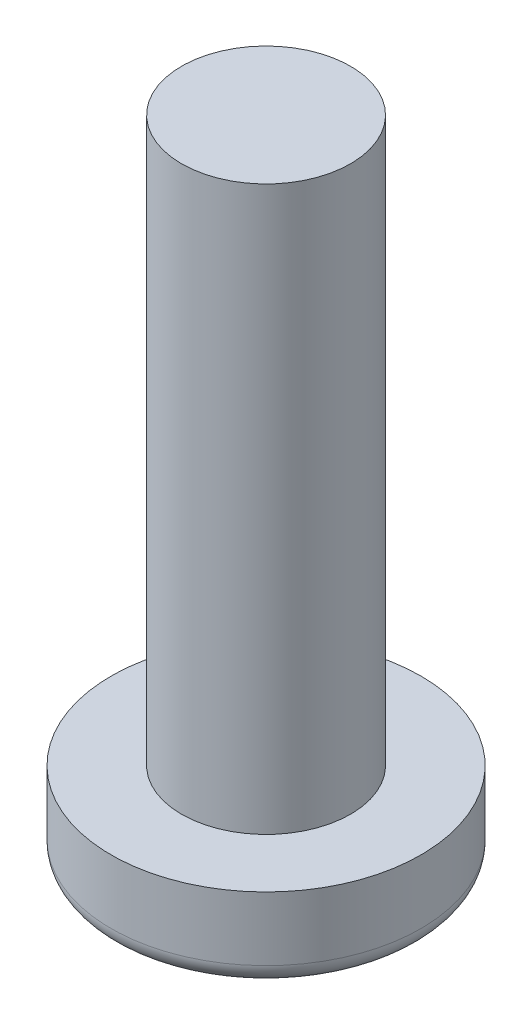
ISO-10303-21;
HEADER;
FILE_DESCRIPTION(('STEP AP214'),'2;1');
FILE_NAME('part.step','',(''),(''),'','','');
FILE_SCHEMA(('AUTOMOTIVE_DESIGN { 1 0 10303 214 1 1 1 1 }'));
ENDSEC;
DATA;
#1=APPLICATION_CONTEXT('core data for automotive mechanical design processes');
#2=APPLICATION_PROTOCOL_DEFINITION('international standard','automotive_design',2000,#1);
#3=PRODUCT_CONTEXT('',#1,'mechanical');
#4=PRODUCT('Part','Part','',(#3));
#5=PRODUCT_RELATED_PRODUCT_CATEGORY('part','',(#4));
#6=PRODUCT_DEFINITION_FORMATION('','',#4);
#7=PRODUCT_DEFINITION_CONTEXT('part definition',#1,'design');
#8=PRODUCT_DEFINITION('design','',#6,#7);
#9=PRODUCT_DEFINITION_SHAPE('','',#8);
#10=(LENGTH_UNIT() NAMED_UNIT(*) SI_UNIT(.MILLI.,.METRE.));
#11=(NAMED_UNIT(*) PLANE_ANGLE_UNIT() SI_UNIT($,.RADIAN.));
#12=(NAMED_UNIT(*) SI_UNIT($,.STERADIAN.) SOLID_ANGLE_UNIT());
#13=UNCERTAINTY_MEASURE_WITH_UNIT(LENGTH_MEASURE(1.E-05),#10,'distance_accuracy_value','');
#14=(GEOMETRIC_REPRESENTATION_CONTEXT(3) GLOBAL_UNCERTAINTY_ASSIGNED_CONTEXT((#13)) GLOBAL_UNIT_ASSIGNED_CONTEXT((#10,
#11,#12)) REPRESENTATION_CONTEXT('',''));
#15=CARTESIAN_POINT('',(0.,0.,0.));
#16=DIRECTION('',(0.,0.,1.));
#17=DIRECTION('',(1.,0.,0.));
#18=AXIS2_PLACEMENT_3D('',#15,#16,#17);
#19=CARTESIAN_POINT('',(0.,1.5,0.));
#20=DIRECTION('',(0.,-1.,0.));
#21=DIRECTION('',(0.,0.,-1.));
#22=AXIS2_PLACEMENT_3D('',#19,#20,#21);
#23=CYLINDRICAL_SURFACE('',#22,2.75);
#24=CARTESIAN_POINT('',(0.,0.367346938775511,0.));
#25=DIRECTION('',(0.,-1.,0.));
#26=DIRECTION('',(0.,0.,-1.));
#27=AXIS2_PLACEMENT_3D('',#24,#25,#26);
#28=CIRCLE('',#27,2.75);
#29=CARTESIAN_POINT('',(0.,0.367346938775511,-2.75));
#30=VERTEX_POINT('',#29);
#31=EDGE_CURVE('E10',#30,#30,#28,.F.);
#32=ORIENTED_EDGE('',*,*,#31,.T.);
#33=EDGE_LOOP('',(#32));
#34=FACE_BOUND('',#33,.T.);
#35=CARTESIAN_POINT('',(0.,1.5,0.));
#36=DIRECTION('',(0.,-1.,0.));
#37=DIRECTION('',(0.,0.,-1.));
#38=AXIS2_PLACEMENT_3D('',#35,#36,#37);
#39=CIRCLE('',#38,2.75);
#40=CARTESIAN_POINT('',(0.,1.5,-2.75));
#41=VERTEX_POINT('',#40);
#42=EDGE_CURVE('E42',#41,#41,#39,.T.);
#43=ORIENTED_EDGE('',*,*,#42,.T.);
#44=EDGE_LOOP('',(#43));
#45=FACE_BOUND('',#44,.T.);
#46=ADVANCED_FACE('F31',(#34,#45),#23,.T.);
#47=CARTESIAN_POINT('',(2.75,1.5,0.));
#48=DIRECTION('',(0.,1.,0.));
#49=DIRECTION('',(0.,0.,1.));
#50=AXIS2_PLACEMENT_3D('',#47,#48,#49);
#51=PLANE('',#50);
#52=CARTESIAN_POINT('',(0.,1.5,0.));
#53=DIRECTION('',(0.,1.,0.));
#54=DIRECTION('',(0.,0.,1.));
#55=AXIS2_PLACEMENT_3D('',#52,#53,#54);
#56=CIRCLE('',#55,1.5);
#57=CARTESIAN_POINT('',(0.,1.5,1.5));
#58=VERTEX_POINT('',#57);
#59=EDGE_CURVE('E49',#58,#58,#56,.T.);
#60=ORIENTED_EDGE('',*,*,#59,.F.);
#61=EDGE_LOOP('',(#60));
#62=FACE_BOUND('',#61,.T.);
#63=ORIENTED_EDGE('',*,*,#42,.F.);
#64=EDGE_LOOP('',(#63));
#65=FACE_BOUND('',#64,.T.);
#66=ADVANCED_FACE('F64',(#62,#65),#51,.T.);
#67=CARTESIAN_POINT('',(0.,0.,0.));
#68=DIRECTION('',(0.,-1.,0.));
#69=DIRECTION('',(0.,0.,-1.));
#70=AXIS2_PLACEMENT_3D('',#67,#68,#69);
#71=PLANE('',#70);
#72=CARTESIAN_POINT('',(0.,0.,0.));
#73=DIRECTION('',(0.,-1.,0.));
#74=DIRECTION('',(0.,0.,-1.));
#75=AXIS2_PLACEMENT_3D('',#72,#73,#74);
#76=CIRCLE('',#75,2.38265306122449);
#77=CARTESIAN_POINT('',(0.,0.,-2.38265306122449));
#78=VERTEX_POINT('',#77);
#79=EDGE_CURVE('E38',#78,#78,#76,.T.);
#80=ORIENTED_EDGE('',*,*,#79,.T.);
#81=EDGE_LOOP('',(#80));
#82=FACE_BOUND('',#81,.T.);
#83=ADVANCED_FACE('F60',(#82),#71,.T.);
#84=CARTESIAN_POINT('',(0.,11.5,0.));
#85=DIRECTION('',(0.,-1.,0.));
#86=DIRECTION('',(0.,0.,-1.));
#87=AXIS2_PLACEMENT_3D('',#84,#85,#86);
#88=CYLINDRICAL_SURFACE('',#87,1.5);
#89=CARTESIAN_POINT('',(0.,11.5,0.));
#90=DIRECTION('',(0.,1.,0.));
#91=DIRECTION('',(0.,0.,1.));
#92=AXIS2_PLACEMENT_3D('',#89,#90,#91);
#93=CIRCLE('',#92,1.5);
#94=CARTESIAN_POINT('',(0.,11.5,1.5));
#95=VERTEX_POINT('',#94);
#96=EDGE_CURVE('E46',#95,#95,#93,.T.);
#97=ORIENTED_EDGE('',*,*,#96,.F.);
#98=EDGE_LOOP('',(#97));
#99=FACE_BOUND('',#98,.T.);
#100=ORIENTED_EDGE('',*,*,#59,.T.);
#101=EDGE_LOOP('',(#100));
#102=FACE_BOUND('',#101,.T.);
#103=ADVANCED_FACE('F57',(#99,#102),#88,.T.);
#104=CARTESIAN_POINT('',(0.,11.5,0.));
#105=DIRECTION('',(0.,1.,0.));
#106=DIRECTION('',(0.,0.,1.));
#107=AXIS2_PLACEMENT_3D('',#104,#105,#106);
#108=PLANE('',#107);
#109=ORIENTED_EDGE('',*,*,#96,.T.);
#110=EDGE_LOOP('',(#109));
#111=FACE_BOUND('',#110,.T.);
#112=ADVANCED_FACE('F55',(#111),#108,.T.);
#113=CARTESIAN_POINT('',(0.,0.367346938775511,0.));
#114=DIRECTION('',(0.,-1.,0.));
#115=DIRECTION('',(0.,0.,-1.));
#116=AXIS2_PLACEMENT_3D('',#113,#114,#115);
#117=TOROIDAL_SURFACE('',#116,2.38265306122449,0.367346938775511);
#118=ORIENTED_EDGE('',*,*,#31,.F.);
#119=EDGE_LOOP('',(#118));
#120=FACE_BOUND('',#119,.T.);
#121=ORIENTED_EDGE('',*,*,#79,.F.);
#122=EDGE_LOOP('',(#121));
#123=FACE_BOUND('',#122,.T.);
#124=ADVANCED_FACE('F33',(#120,#123),#117,.T.);
#125=CLOSED_SHELL('',(#46,#66,#83,#103,#112,#124));
#126=MANIFOLD_SOLID_BREP('B2',#125);
#127=ADVANCED_BREP_SHAPE_REPRESENTATION('',(#18,#126),#14);
#128=SHAPE_DEFINITION_REPRESENTATION(#9,#127);
ENDSEC;
END-ISO-10303-21;
